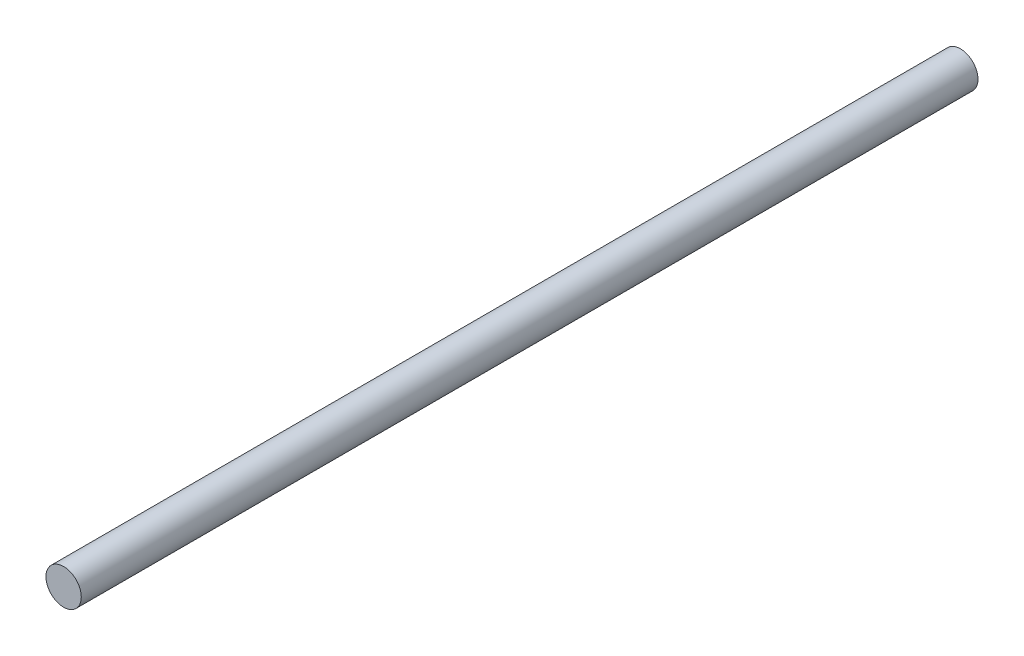
ISO-10303-21;
HEADER;
FILE_DESCRIPTION(('STEP AP214'),'2;1');
FILE_NAME('part.step','',(''),(''),'','','');
FILE_SCHEMA(('AUTOMOTIVE_DESIGN { 1 0 10303 214 1 1 1 1 }'));
ENDSEC;
DATA;
#1=APPLICATION_CONTEXT('core data for automotive mechanical design processes');
#2=APPLICATION_PROTOCOL_DEFINITION('international standard','automotive_design',2000,#1);
#3=PRODUCT_CONTEXT('',#1,'mechanical');
#4=PRODUCT('Part','Part','',(#3));
#5=PRODUCT_RELATED_PRODUCT_CATEGORY('part','',(#4));
#6=PRODUCT_DEFINITION_FORMATION('','',#4);
#7=PRODUCT_DEFINITION_CONTEXT('part definition',#1,'design');
#8=PRODUCT_DEFINITION('design','',#6,#7);
#9=PRODUCT_DEFINITION_SHAPE('','',#8);
#10=(LENGTH_UNIT() NAMED_UNIT(*) SI_UNIT(.MILLI.,.METRE.));
#11=(NAMED_UNIT(*) PLANE_ANGLE_UNIT() SI_UNIT($,.RADIAN.));
#12=(NAMED_UNIT(*) SI_UNIT($,.STERADIAN.) SOLID_ANGLE_UNIT());
#13=UNCERTAINTY_MEASURE_WITH_UNIT(LENGTH_MEASURE(1.E-05),#10,'distance_accuracy_value','');
#14=(GEOMETRIC_REPRESENTATION_CONTEXT(3) GLOBAL_UNCERTAINTY_ASSIGNED_CONTEXT((#13)) GLOBAL_UNIT_ASSIGNED_CONTEXT((#10,
#11,#12)) REPRESENTATION_CONTEXT('',''));
#15=CARTESIAN_POINT('',(0.,0.,0.));
#16=DIRECTION('',(0.,0.,1.));
#17=DIRECTION('',(1.,0.,0.));
#18=AXIS2_PLACEMENT_3D('',#15,#16,#17);
#19=CARTESIAN_POINT('',(0.,0.,152.4));
#20=DIRECTION('',(0.,0.,-1.));
#21=DIRECTION('',(-1.,0.,0.));
#22=AXIS2_PLACEMENT_3D('',#19,#20,#21);
#23=CYLINDRICAL_SURFACE('',#22,2.999994);
#24=CARTESIAN_POINT('',(0.,0.,152.4));
#25=DIRECTION('',(0.,0.,1.));
#26=DIRECTION('',(1.,0.,0.));
#27=AXIS2_PLACEMENT_3D('',#24,#25,#26);
#28=CIRCLE('',#27,2.999994);
#29=CARTESIAN_POINT('',(2.999994,0.,152.4));
#30=VERTEX_POINT('',#29);
#31=EDGE_CURVE('E10',#30,#30,#28,.T.);
#32=ORIENTED_EDGE('',*,*,#31,.F.);
#33=EDGE_LOOP('',(#32));
#34=FACE_BOUND('',#33,.T.);
#35=CARTESIAN_POINT('',(0.,0.,0.));
#36=DIRECTION('',(0.,0.,1.));
#37=DIRECTION('',(1.,0.,0.));
#38=AXIS2_PLACEMENT_3D('',#35,#36,#37);
#39=CIRCLE('',#38,2.999994);
#40=CARTESIAN_POINT('',(2.999994,0.,0.));
#41=VERTEX_POINT('',#40);
#42=EDGE_CURVE('E39',#41,#41,#39,.T.);
#43=ORIENTED_EDGE('',*,*,#42,.T.);
#44=EDGE_LOOP('',(#43));
#45=FACE_BOUND('',#44,.T.);
#46=ADVANCED_FACE('F36',(#34,#45),#23,.T.);
#47=CARTESIAN_POINT('',(0.,0.,152.4));
#48=DIRECTION('',(0.,0.,1.));
#49=DIRECTION('',(1.,0.,0.));
#50=AXIS2_PLACEMENT_3D('',#47,#48,#49);
#51=PLANE('',#50);
#52=ORIENTED_EDGE('',*,*,#31,.T.);
#53=EDGE_LOOP('',(#52));
#54=FACE_BOUND('',#53,.T.);
#55=ADVANCED_FACE('F51',(#54),#51,.T.);
#56=CARTESIAN_POINT('',(0.,0.,0.));
#57=DIRECTION('',(0.,0.,1.));
#58=DIRECTION('',(1.,0.,0.));
#59=AXIS2_PLACEMENT_3D('',#56,#57,#58);
#60=PLANE('',#59);
#61=ORIENTED_EDGE('',*,*,#42,.F.);
#62=EDGE_LOOP('',(#61));
#63=FACE_BOUND('',#62,.T.);
#64=ADVANCED_FACE('F49',(#63),#60,.F.);
#65=CLOSED_SHELL('',(#46,#55,#64));
#66=MANIFOLD_SOLID_BREP('B2',#65);
#67=ADVANCED_BREP_SHAPE_REPRESENTATION('',(#18,#66),#14);
#68=SHAPE_DEFINITION_REPRESENTATION(#9,#67);
ENDSEC;
END-ISO-10303-21;
